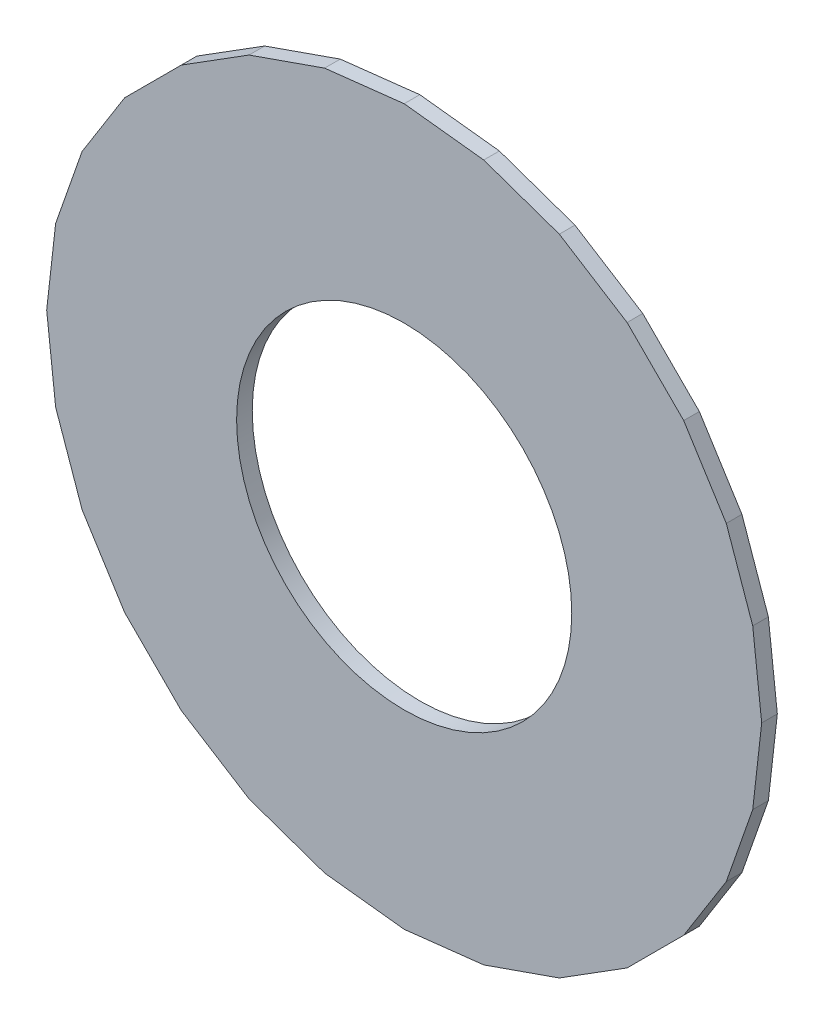
ISO-10303-21;
HEADER;
FILE_DESCRIPTION(('STEP AP214'),'2;1');
FILE_NAME('part.step','',(''),(''),'','','');
FILE_SCHEMA(('AUTOMOTIVE_DESIGN { 1 0 10303 214 1 1 1 1 }'));
ENDSEC;
DATA;
#1=APPLICATION_CONTEXT('core data for automotive mechanical design processes');
#2=APPLICATION_PROTOCOL_DEFINITION('international standard','automotive_design',2000,#1);
#3=PRODUCT_CONTEXT('',#1,'mechanical');
#4=PRODUCT('Part','Part','',(#3));
#5=PRODUCT_RELATED_PRODUCT_CATEGORY('part','',(#4));
#6=PRODUCT_DEFINITION_FORMATION('','',#4);
#7=PRODUCT_DEFINITION_CONTEXT('part definition',#1,'design');
#8=PRODUCT_DEFINITION('design','',#6,#7);
#9=PRODUCT_DEFINITION_SHAPE('','',#8);
#10=(LENGTH_UNIT() NAMED_UNIT(*) SI_UNIT(.MILLI.,.METRE.));
#11=(NAMED_UNIT(*) PLANE_ANGLE_UNIT() SI_UNIT($,.RADIAN.));
#12=(NAMED_UNIT(*) SI_UNIT($,.STERADIAN.) SOLID_ANGLE_UNIT());
#13=UNCERTAINTY_MEASURE_WITH_UNIT(LENGTH_MEASURE(1.E-05),#10,'distance_accuracy_value','');
#14=(GEOMETRIC_REPRESENTATION_CONTEXT(3) GLOBAL_UNCERTAINTY_ASSIGNED_CONTEXT((#13)) GLOBAL_UNIT_ASSIGNED_CONTEXT((#10,
#11,#12)) REPRESENTATION_CONTEXT('',''));
#15=CARTESIAN_POINT('',(0.,0.,0.));
#16=DIRECTION('',(0.,0.,1.));
#17=DIRECTION('',(1.,0.,0.));
#18=AXIS2_PLACEMENT_3D('',#15,#16,#17);
#19=CARTESIAN_POINT('',(165.608,-76.2,-0.045));
#20=DIRECTION('',(0.,0.,-1.));
#21=DIRECTION('',(0.,-1.,0.));
#22=AXIS2_PLACEMENT_3D('',#19,#20,#21);
#23=CYLINDRICAL_SURFACE('',#22,0.375);
#24=CARTESIAN_POINT('',(165.608,-76.2,-0.035));
#25=DIRECTION('',(0.,0.,-1.));
#26=DIRECTION('',(0.,-1.,0.));
#27=AXIS2_PLACEMENT_3D('',#24,#25,#26);
#28=CIRCLE('',#27,0.375);
#29=CARTESIAN_POINT('',(165.608,-76.575,-0.035));
#30=VERTEX_POINT('',#29);
#31=EDGE_CURVE('E325',#30,#30,#28,.T.);
#32=ORIENTED_EDGE('',*,*,#31,.T.);
#33=DIRECTION('',(0.,0.,1.));
#34=VECTOR('',#33,1.);
#35=CARTESIAN_POINT('',(165.608,-76.575,-0.045));
#36=LINE('',#35,#34);
#37=CARTESIAN_POINT('',(165.608,-76.575,0.));
#38=VERTEX_POINT('',#37);
#39=EDGE_CURVE('E11',#30,#38,#36,.T.);
#40=ORIENTED_EDGE('',*,*,#39,.T.);
#41=CARTESIAN_POINT('',(165.608,-76.2,0.));
#42=DIRECTION('',(0.,0.,-1.));
#43=DIRECTION('',(0.,-1.,0.));
#44=AXIS2_PLACEMENT_3D('',#41,#42,#43);
#45=CIRCLE('',#44,0.375);
#46=EDGE_CURVE('E392',#38,#38,#45,.T.);
#47=ORIENTED_EDGE('',*,*,#46,.F.);
#48=ORIENTED_EDGE('',*,*,#39,.F.);
#49=EDGE_LOOP('',(#32,#40,#47,#48));
#50=FACE_BOUND('',#49,.T.);
#51=ADVANCED_FACE('F17',(#50),#23,.F.);
#52=CARTESIAN_POINT('',(165.429983,-76.979942,-0.035));
#53=DIRECTION('',(-0.330278315977027,-0.943883591337077,0.));
#54=DIRECTION('',(-0.943883591337077,0.330278315977027,0.));
#55=AXIS2_PLACEMENT_3D('',#52,#53,#54);
#56=PLANE('',#55);
#57=DIRECTION('',(0.,0.,1.));
#58=VECTOR('',#57,1.);
#59=CARTESIAN_POINT('',(165.429983,-76.979942,-0.035));
#60=LINE('',#59,#58);
#61=CARTESIAN_POINT('',(165.429983,-76.979942,-0.035));
#62=VERTEX_POINT('',#61);
#63=CARTESIAN_POINT('',(165.429983,-76.979942,0.));
#64=VERTEX_POINT('',#63);
#65=EDGE_CURVE('E26',#62,#64,#60,.T.);
#66=ORIENTED_EDGE('',*,*,#65,.T.);
#67=DIRECTION('',(-0.943883591337077,0.330278315977027,0.));
#68=VECTOR('',#67,1.);
#69=CARTESIAN_POINT('',(165.429983,-76.979942,0.));
#70=LINE('',#69,#68);
#71=CARTESIAN_POINT('',(165.260893,-76.920775,0.));
#72=VERTEX_POINT('',#71);
#73=EDGE_CURVE('E320',#64,#72,#70,.T.);
#74=ORIENTED_EDGE('',*,*,#73,.T.);
#75=DIRECTION('',(0.,0.,1.));
#76=VECTOR('',#75,1.);
#77=CARTESIAN_POINT('',(165.260893,-76.920775,-0.035));
#78=LINE('',#77,#76);
#79=CARTESIAN_POINT('',(165.260893,-76.920775,-0.035));
#80=VERTEX_POINT('',#79);
#81=EDGE_CURVE('E441',#80,#72,#78,.T.);
#82=ORIENTED_EDGE('',*,*,#81,.F.);
#83=DIRECTION('',(-0.943883591337077,0.330278315977027,0.));
#84=VECTOR('',#83,1.);
#85=CARTESIAN_POINT('',(165.429983,-76.979942,-0.035));
#86=LINE('',#85,#84);
#87=EDGE_CURVE('E454',#62,#80,#86,.T.);
#88=ORIENTED_EDGE('',*,*,#87,.F.);
#89=EDGE_LOOP('',(#66,#74,#82,#88));
#90=FACE_BOUND('',#89,.T.);
#91=ADVANCED_FACE('F450',(#90),#56,.T.);
#92=CARTESIAN_POINT('',(165.608,-77.,-0.035));
#93=DIRECTION('',(-0.111966136678988,-0.993712022789894,0.));
#94=DIRECTION('',(-0.993712022789894,0.111966136678988,0.));
#95=AXIS2_PLACEMENT_3D('',#92,#93,#94);
#96=PLANE('',#95);
#97=DIRECTION('',(0.,0.,1.));
#98=VECTOR('',#97,1.);
#99=CARTESIAN_POINT('',(165.608,-77.,-0.035));
#100=LINE('',#99,#98);
#101=CARTESIAN_POINT('',(165.608,-77.,-0.035));
#102=VERTEX_POINT('',#101);
#103=CARTESIAN_POINT('',(165.608,-77.,0.));
#104=VERTEX_POINT('',#103);
#105=EDGE_CURVE('E440',#102,#104,#100,.T.);
#106=ORIENTED_EDGE('',*,*,#105,.T.);
#107=DIRECTION('',(-0.993712022789894,0.111966136678988,0.));
#108=VECTOR('',#107,1.);
#109=CARTESIAN_POINT('',(165.608,-77.,0.));
#110=LINE('',#109,#108);
#111=EDGE_CURVE('E372',#104,#64,#110,.T.);
#112=ORIENTED_EDGE('',*,*,#111,.T.);
#113=ORIENTED_EDGE('',*,*,#65,.F.);
#114=DIRECTION('',(-0.993712022789894,0.111966136678988,0.));
#115=VECTOR('',#114,1.);
#116=CARTESIAN_POINT('',(165.608,-77.,-0.035));
#117=LINE('',#116,#115);
#118=EDGE_CURVE('E892',#102,#62,#117,.T.);
#119=ORIENTED_EDGE('',*,*,#118,.F.);
#120=EDGE_LOOP('',(#106,#112,#113,#119));
#121=FACE_BOUND('',#120,.T.);
#122=ADVANCED_FACE('F459',(#121),#96,.T.);
#123=CARTESIAN_POINT('',(165.260893,-76.920775,-0.035));
#124=DIRECTION('',(-0.532032066600227,-0.846724205458361,0.));
#125=DIRECTION('',(-0.846724205458361,0.532032066600227,0.));
#126=AXIS2_PLACEMENT_3D('',#123,#124,#125);
#127=PLANE('',#126);
#128=ORIENTED_EDGE('',*,*,#81,.T.);
#129=DIRECTION('',(-0.846724205458361,0.532032066600227,0.));
#130=VECTOR('',#129,1.);
#131=CARTESIAN_POINT('',(165.260893,-76.920775,0.));
#132=LINE('',#131,#130);
#133=CARTESIAN_POINT('',(165.109208,-76.825465,0.));
#134=VERTEX_POINT('',#133);
#135=EDGE_CURVE('E316',#72,#134,#132,.T.);
#136=ORIENTED_EDGE('',*,*,#135,.T.);
#137=DIRECTION('',(0.,0.,1.));
#138=VECTOR('',#137,1.);
#139=CARTESIAN_POINT('',(165.109208,-76.825465,-0.035));
#140=LINE('',#139,#138);
#141=CARTESIAN_POINT('',(165.109208,-76.825465,-0.035));
#142=VERTEX_POINT('',#141);
#143=EDGE_CURVE('E437',#142,#134,#140,.T.);
#144=ORIENTED_EDGE('',*,*,#143,.F.);
#145=DIRECTION('',(-0.846724205458361,0.532032066600227,0.));
#146=VECTOR('',#145,1.);
#147=CARTESIAN_POINT('',(165.260893,-76.920775,-0.035));
#148=LINE('',#147,#146);
#149=EDGE_CURVE('E473',#80,#142,#148,.T.);
#150=ORIENTED_EDGE('',*,*,#149,.F.);
#151=EDGE_LOOP('',(#128,#136,#144,#150));
#152=FACE_BOUND('',#151,.T.);
#153=ADVANCED_FACE('F748',(#152),#127,.T.);
#154=CARTESIAN_POINT('',(165.786017,-76.979942,-0.035));
#155=DIRECTION('',(0.111966136678988,-0.993712022789894,0.));
#156=DIRECTION('',(0.,0.,-1.));
#157=AXIS2_PLACEMENT_3D('',#154,#155,#156);
#158=PLANE('',#157);
#159=DIRECTION('',(0.,0.,1.));
#160=VECTOR('',#159,1.);
#161=CARTESIAN_POINT('',(165.786017,-76.979942,-0.035));
#162=LINE('',#161,#160);
#163=CARTESIAN_POINT('',(165.786017,-76.979942,-0.035));
#164=VERTEX_POINT('',#163);
#165=CARTESIAN_POINT('',(165.786017,-76.979942,0.));
#166=VERTEX_POINT('',#165);
#167=EDGE_CURVE('E434',#164,#166,#162,.T.);
#168=ORIENTED_EDGE('',*,*,#167,.T.);
#169=DIRECTION('',(-0.993712022789894,-0.111966136678988,0.));
#170=VECTOR('',#169,1.);
#171=CARTESIAN_POINT('',(165.786017,-76.979942,0.));
#172=LINE('',#171,#170);
#173=EDGE_CURVE('E367',#166,#104,#172,.T.);
#174=ORIENTED_EDGE('',*,*,#173,.T.);
#175=ORIENTED_EDGE('',*,*,#105,.F.);
#176=DIRECTION('',(-0.993712022789894,-0.111966136678988,0.));
#177=VECTOR('',#176,1.);
#178=CARTESIAN_POINT('',(165.786017,-76.979942,-0.035));
#179=LINE('',#178,#177);
#180=EDGE_CURVE('E884',#164,#102,#179,.T.);
#181=ORIENTED_EDGE('',*,*,#180,.F.);
#182=EDGE_LOOP('',(#168,#174,#175,#181));
#183=FACE_BOUND('',#182,.T.);
#184=ADVANCED_FACE('F739',(#183),#158,.T.);
#185=CARTESIAN_POINT('',(165.109208,-76.825465,-0.035));
#186=DIRECTION('',(-0.707106781186548,-0.707106781186548,0.));
#187=DIRECTION('',(-0.707106781186548,0.707106781186548,0.));
#188=AXIS2_PLACEMENT_3D('',#185,#186,#187);
#189=PLANE('',#188);
#190=ORIENTED_EDGE('',*,*,#143,.T.);
#191=DIRECTION('',(-0.707106781186548,0.707106781186548,0.));
#192=VECTOR('',#191,1.);
#193=CARTESIAN_POINT('',(165.109208,-76.825465,0.));
#194=LINE('',#193,#192);
#195=CARTESIAN_POINT('',(164.982535,-76.698792,0.));
#196=VERTEX_POINT('',#195);
#197=EDGE_CURVE('E321',#134,#196,#194,.T.);
#198=ORIENTED_EDGE('',*,*,#197,.T.);
#199=DIRECTION('',(0.,0.,1.));
#200=VECTOR('',#199,1.);
#201=CARTESIAN_POINT('',(164.982535,-76.698792,-0.035));
#202=LINE('',#201,#200);
#203=CARTESIAN_POINT('',(164.982535,-76.698792,-0.035));
#204=VERTEX_POINT('',#203);
#205=EDGE_CURVE('E431',#204,#196,#202,.T.);
#206=ORIENTED_EDGE('',*,*,#205,.F.);
#207=DIRECTION('',(-0.707106781186548,0.707106781186548,0.));
#208=VECTOR('',#207,1.);
#209=CARTESIAN_POINT('',(165.109208,-76.825465,-0.035));
#210=LINE('',#209,#208);
#211=EDGE_CURVE('E475',#142,#204,#210,.T.);
#212=ORIENTED_EDGE('',*,*,#211,.F.);
#213=EDGE_LOOP('',(#190,#198,#206,#212));
#214=FACE_BOUND('',#213,.T.);
#215=ADVANCED_FACE('F730',(#214),#189,.T.);
#216=CARTESIAN_POINT('',(165.955107,-76.920775,-0.035));
#217=DIRECTION('',(0.330278315977027,-0.943883591337077,0.));
#218=DIRECTION('',(0.,0.,-1.));
#219=AXIS2_PLACEMENT_3D('',#216,#217,#218);
#220=PLANE('',#219);
#221=DIRECTION('',(0.,0.,1.));
#222=VECTOR('',#221,1.);
#223=CARTESIAN_POINT('',(165.955107,-76.920775,-0.035));
#224=LINE('',#223,#222);
#225=CARTESIAN_POINT('',(165.955107,-76.920775,-0.035));
#226=VERTEX_POINT('',#225);
#227=CARTESIAN_POINT('',(165.955107,-76.920775,0.));
#228=VERTEX_POINT('',#227);
#229=EDGE_CURVE('E428',#226,#228,#224,.T.);
#230=ORIENTED_EDGE('',*,*,#229,.T.);
#231=DIRECTION('',(-0.943883591337077,-0.330278315977027,0.));
#232=VECTOR('',#231,1.);
#233=CARTESIAN_POINT('',(165.955107,-76.920775,0.));
#234=LINE('',#233,#232);
#235=EDGE_CURVE('E371',#228,#166,#234,.T.);
#236=ORIENTED_EDGE('',*,*,#235,.T.);
#237=ORIENTED_EDGE('',*,*,#167,.F.);
#238=DIRECTION('',(-0.943883591337077,-0.330278315977027,0.));
#239=VECTOR('',#238,1.);
#240=CARTESIAN_POINT('',(165.955107,-76.920775,-0.035));
#241=LINE('',#240,#239);
#242=EDGE_CURVE('E880',#226,#164,#241,.T.);
#243=ORIENTED_EDGE('',*,*,#242,.F.);
#244=EDGE_LOOP('',(#230,#236,#237,#243));
#245=FACE_BOUND('',#244,.T.);
#246=ADVANCED_FACE('F722',(#245),#220,.T.);
#247=CARTESIAN_POINT('',(164.982535,-76.698792,-0.035));
#248=DIRECTION('',(-0.846724205458361,-0.532032066600227,0.));
#249=DIRECTION('',(-0.532032066600227,0.846724205458361,0.));
#250=AXIS2_PLACEMENT_3D('',#247,#248,#249);
#251=PLANE('',#250);
#252=ORIENTED_EDGE('',*,*,#205,.T.);
#253=DIRECTION('',(-0.532032066600227,0.846724205458361,0.));
#254=VECTOR('',#253,1.);
#255=CARTESIAN_POINT('',(164.982535,-76.698792,0.));
#256=LINE('',#255,#254);
#257=CARTESIAN_POINT('',(164.887225,-76.547107,0.));
#258=VERTEX_POINT('',#257);
#259=EDGE_CURVE('E366',#196,#258,#256,.T.);
#260=ORIENTED_EDGE('',*,*,#259,.T.);
#261=DIRECTION('',(0.,0.,1.));
#262=VECTOR('',#261,1.);
#263=CARTESIAN_POINT('',(164.887225,-76.547107,-0.035));
#264=LINE('',#263,#262);
#265=CARTESIAN_POINT('',(164.887225,-76.547107,-0.035));
#266=VERTEX_POINT('',#265);
#267=EDGE_CURVE('E425',#266,#258,#264,.T.);
#268=ORIENTED_EDGE('',*,*,#267,.F.);
#269=DIRECTION('',(-0.532032066600227,0.846724205458361,0.));
#270=VECTOR('',#269,1.);
#271=CARTESIAN_POINT('',(164.982535,-76.698792,-0.035));
#272=LINE('',#271,#270);
#273=EDGE_CURVE('E279',#204,#266,#272,.T.);
#274=ORIENTED_EDGE('',*,*,#273,.F.);
#275=EDGE_LOOP('',(#252,#260,#268,#274));
#276=FACE_BOUND('',#275,.T.);
#277=ADVANCED_FACE('F485',(#276),#251,.T.);
#278=CARTESIAN_POINT('',(166.106792,-76.825465,-0.035));
#279=DIRECTION('',(0.532032066600227,-0.846724205458361,0.));
#280=DIRECTION('',(0.,0.,-1.));
#281=AXIS2_PLACEMENT_3D('',#278,#279,#280);
#282=PLANE('',#281);
#283=DIRECTION('',(0.,0.,1.));
#284=VECTOR('',#283,1.);
#285=CARTESIAN_POINT('',(166.106792,-76.825465,-0.035));
#286=LINE('',#285,#284);
#287=CARTESIAN_POINT('',(166.106792,-76.825465,-0.035));
#288=VERTEX_POINT('',#287);
#289=CARTESIAN_POINT('',(166.106792,-76.825465,0.));
#290=VERTEX_POINT('',#289);
#291=EDGE_CURVE('E422',#288,#290,#286,.T.);
#292=ORIENTED_EDGE('',*,*,#291,.T.);
#293=DIRECTION('',(-0.846724205458361,-0.532032066600227,0.));
#294=VECTOR('',#293,1.);
#295=CARTESIAN_POINT('',(166.106792,-76.825465,0.));
#296=LINE('',#295,#294);
#297=EDGE_CURVE('E348',#290,#228,#296,.T.);
#298=ORIENTED_EDGE('',*,*,#297,.T.);
#299=ORIENTED_EDGE('',*,*,#229,.F.);
#300=DIRECTION('',(-0.846724205458361,-0.532032066600227,0.));
#301=VECTOR('',#300,1.);
#302=CARTESIAN_POINT('',(166.106792,-76.825465,-0.035));
#303=LINE('',#302,#301);
#304=EDGE_CURVE('E876',#288,#226,#303,.T.);
#305=ORIENTED_EDGE('',*,*,#304,.F.);
#306=EDGE_LOOP('',(#292,#298,#299,#305));
#307=FACE_BOUND('',#306,.T.);
#308=ADVANCED_FACE('F492',(#307),#282,.T.);
#309=CARTESIAN_POINT('',(164.887225,-76.547107,-0.035));
#310=DIRECTION('',(-0.943883591337077,-0.330278315977027,0.));
#311=DIRECTION('',(-0.330278315977027,0.943883591337077,0.));
#312=AXIS2_PLACEMENT_3D('',#309,#310,#311);
#313=PLANE('',#312);
#314=ORIENTED_EDGE('',*,*,#267,.T.);
#315=DIRECTION('',(-0.330278315977027,0.943883591337077,0.));
#316=VECTOR('',#315,1.);
#317=CARTESIAN_POINT('',(164.887225,-76.547107,0.));
#318=LINE('',#317,#316);
#319=CARTESIAN_POINT('',(164.828058,-76.378017,0.));
#320=VERTEX_POINT('',#319);
#321=EDGE_CURVE('E362',#258,#320,#318,.T.);
#322=ORIENTED_EDGE('',*,*,#321,.T.);
#323=DIRECTION('',(0.,0.,1.));
#324=VECTOR('',#323,1.);
#325=CARTESIAN_POINT('',(164.828058,-76.378017,-0.035));
#326=LINE('',#325,#324);
#327=CARTESIAN_POINT('',(164.828058,-76.378017,-0.035));
#328=VERTEX_POINT('',#327);
#329=EDGE_CURVE('E237',#328,#320,#326,.T.);
#330=ORIENTED_EDGE('',*,*,#329,.F.);
#331=DIRECTION('',(-0.330278315977027,0.943883591337077,0.));
#332=VECTOR('',#331,1.);
#333=CARTESIAN_POINT('',(164.887225,-76.547107,-0.035));
#334=LINE('',#333,#332);
#335=EDGE_CURVE('E272',#266,#328,#334,.T.);
#336=ORIENTED_EDGE('',*,*,#335,.F.);
#337=EDGE_LOOP('',(#314,#322,#330,#336));
#338=FACE_BOUND('',#337,.T.);
#339=ADVANCED_FACE('F489',(#338),#313,.T.);
#340=CARTESIAN_POINT('',(166.233465,-76.698792,-0.035));
#341=DIRECTION('',(0.707106781186548,-0.707106781186548,0.));
#342=DIRECTION('',(0.,0.,-1.));
#343=AXIS2_PLACEMENT_3D('',#340,#341,#342);
#344=PLANE('',#343);
#345=DIRECTION('',(0.,0.,1.));
#346=VECTOR('',#345,1.);
#347=CARTESIAN_POINT('',(166.233465,-76.698792,-0.035));
#348=LINE('',#347,#346);
#349=CARTESIAN_POINT('',(166.233465,-76.698792,-0.035));
#350=VERTEX_POINT('',#349);
#351=CARTESIAN_POINT('',(166.233465,-76.698792,0.));
#352=VERTEX_POINT('',#351);
#353=EDGE_CURVE('E256',#350,#352,#348,.T.);
#354=ORIENTED_EDGE('',*,*,#353,.T.);
#355=DIRECTION('',(-0.707106781186548,-0.707106781186548,0.));
#356=VECTOR('',#355,1.);
#357=CARTESIAN_POINT('',(166.233465,-76.698792,0.));
#358=LINE('',#357,#356);
#359=EDGE_CURVE('E343',#352,#290,#358,.T.);
#360=ORIENTED_EDGE('',*,*,#359,.T.);
#361=ORIENTED_EDGE('',*,*,#291,.F.);
#362=DIRECTION('',(-0.707106781186548,-0.707106781186548,0.));
#363=VECTOR('',#362,1.);
#364=CARTESIAN_POINT('',(166.233465,-76.698792,-0.035));
#365=LINE('',#364,#363);
#366=EDGE_CURVE('E872',#350,#288,#365,.T.);
#367=ORIENTED_EDGE('',*,*,#366,.F.);
#368=EDGE_LOOP('',(#354,#360,#361,#367));
#369=FACE_BOUND('',#368,.T.);
#370=ADVANCED_FACE('F491',(#369),#344,.T.);
#371=CARTESIAN_POINT('',(164.828058,-76.378017,-0.035));
#372=DIRECTION('',(-0.993712022789894,-0.111966136678988,0.));
#373=DIRECTION('',(-0.111966136678988,0.993712022789894,0.));
#374=AXIS2_PLACEMENT_3D('',#371,#372,#373);
#375=PLANE('',#374);
#376=ORIENTED_EDGE('',*,*,#329,.T.);
#377=DIRECTION('',(-0.111966136678988,0.993712022789894,0.));
#378=VECTOR('',#377,1.);
#379=CARTESIAN_POINT('',(164.828058,-76.378017,0.));
#380=LINE('',#379,#378);
#381=CARTESIAN_POINT('',(164.808,-76.2,0.));
#382=VERTEX_POINT('',#381);
#383=EDGE_CURVE('E251',#320,#382,#380,.T.);
#384=ORIENTED_EDGE('',*,*,#383,.T.);
#385=DIRECTION('',(0.,0.,1.));
#386=VECTOR('',#385,1.);
#387=CARTESIAN_POINT('',(164.808,-76.2,-0.035));
#388=LINE('',#387,#386);
#389=CARTESIAN_POINT('',(164.808,-76.2,-0.035));
#390=VERTEX_POINT('',#389);
#391=EDGE_CURVE('E244',#390,#382,#388,.T.);
#392=ORIENTED_EDGE('',*,*,#391,.F.);
#393=DIRECTION('',(-0.111966136678988,0.993712022789894,0.));
#394=VECTOR('',#393,1.);
#395=CARTESIAN_POINT('',(164.828058,-76.378017,-0.035));
#396=LINE('',#395,#394);
#397=EDGE_CURVE('E248',#328,#390,#396,.T.);
#398=ORIENTED_EDGE('',*,*,#397,.F.);
#399=EDGE_LOOP('',(#376,#384,#392,#398));
#400=FACE_BOUND('',#399,.T.);
#401=ADVANCED_FACE('F246',(#400),#375,.T.);
#402=CARTESIAN_POINT('',(166.328775,-76.547107,-0.035));
#403=DIRECTION('',(0.846724205458361,-0.532032066600227,0.));
#404=DIRECTION('',(0.,0.,-1.));
#405=AXIS2_PLACEMENT_3D('',#402,#403,#404);
#406=PLANE('',#405);
#407=DIRECTION('',(0.,0.,1.));
#408=VECTOR('',#407,1.);
#409=CARTESIAN_POINT('',(166.328775,-76.547107,-0.035));
#410=LINE('',#409,#408);
#411=CARTESIAN_POINT('',(166.328775,-76.547107,-0.035));
#412=VERTEX_POINT('',#411);
#413=CARTESIAN_POINT('',(166.328775,-76.547107,0.));
#414=VERTEX_POINT('',#413);
#415=EDGE_CURVE('E257',#412,#414,#410,.T.);
#416=ORIENTED_EDGE('',*,*,#415,.T.);
#417=DIRECTION('',(-0.532032066600227,-0.846724205458361,0.));
#418=VECTOR('',#417,1.);
#419=CARTESIAN_POINT('',(166.328775,-76.547107,0.));
#420=LINE('',#419,#418);
#421=EDGE_CURVE('E347',#414,#352,#420,.T.);
#422=ORIENTED_EDGE('',*,*,#421,.T.);
#423=ORIENTED_EDGE('',*,*,#353,.F.);
#424=DIRECTION('',(-0.532032066600227,-0.846724205458361,0.));
#425=VECTOR('',#424,1.);
#426=CARTESIAN_POINT('',(166.328775,-76.547107,-0.035));
#427=LINE('',#426,#425);
#428=EDGE_CURVE('E868',#412,#350,#427,.T.);
#429=ORIENTED_EDGE('',*,*,#428,.F.);
#430=EDGE_LOOP('',(#416,#422,#423,#429));
#431=FACE_BOUND('',#430,.T.);
#432=ADVANCED_FACE('F566',(#431),#406,.T.);
#433=CARTESIAN_POINT('',(164.808,-76.2,-0.035));
#434=DIRECTION('',(-0.993712022789894,0.111966136678988,0.));
#435=DIRECTION('',(0.,0.,1.));
#436=AXIS2_PLACEMENT_3D('',#433,#434,#435);
#437=PLANE('',#436);
#438=ORIENTED_EDGE('',*,*,#391,.T.);
#439=DIRECTION('',(0.111966136678988,0.993712022789894,0.));
#440=VECTOR('',#439,1.);
#441=CARTESIAN_POINT('',(164.808,-76.2,0.));
#442=LINE('',#441,#440);
#443=CARTESIAN_POINT('',(164.828058,-76.021983,0.));
#444=VERTEX_POINT('',#443);
#445=EDGE_CURVE('E352',#382,#444,#442,.T.);
#446=ORIENTED_EDGE('',*,*,#445,.T.);
#447=DIRECTION('',(0.,0.,1.));
#448=VECTOR('',#447,1.);
#449=CARTESIAN_POINT('',(164.828058,-76.021983,-0.035));
#450=LINE('',#449,#448);
#451=CARTESIAN_POINT('',(164.828058,-76.021983,-0.035));
#452=VERTEX_POINT('',#451);
#453=EDGE_CURVE('E262',#452,#444,#450,.T.);
#454=ORIENTED_EDGE('',*,*,#453,.F.);
#455=DIRECTION('',(0.111966136678988,0.993712022789894,0.));
#456=VECTOR('',#455,1.);
#457=CARTESIAN_POINT('',(164.808,-76.2,-0.035));
#458=LINE('',#457,#456);
#459=EDGE_CURVE('E260',#390,#452,#458,.T.);
#460=ORIENTED_EDGE('',*,*,#459,.F.);
#461=EDGE_LOOP('',(#438,#446,#454,#460));
#462=FACE_BOUND('',#461,.T.);
#463=ADVANCED_FACE('F261',(#462),#437,.T.);
#464=CARTESIAN_POINT('',(166.387942,-76.378017,-0.035));
#465=DIRECTION('',(0.943883591337077,-0.330278315977027,0.));
#466=DIRECTION('',(0.,0.,-1.));
#467=AXIS2_PLACEMENT_3D('',#464,#465,#466);
#468=PLANE('',#467);
#469=DIRECTION('',(0.,0.,1.));
#470=VECTOR('',#469,1.);
#471=CARTESIAN_POINT('',(166.387942,-76.378017,-0.035));
#472=LINE('',#471,#470);
#473=CARTESIAN_POINT('',(166.387942,-76.378017,-0.035));
#474=VERTEX_POINT('',#473);
#475=CARTESIAN_POINT('',(166.387942,-76.378017,0.));
#476=VERTEX_POINT('',#475);
#477=EDGE_CURVE('E415',#474,#476,#472,.T.);
#478=ORIENTED_EDGE('',*,*,#477,.T.);
#479=DIRECTION('',(-0.330278315977027,-0.943883591337077,0.));
#480=VECTOR('',#479,1.);
#481=CARTESIAN_POINT('',(166.387942,-76.378017,0.));
#482=LINE('',#481,#480);
#483=EDGE_CURVE('E382',#476,#414,#482,.T.);
#484=ORIENTED_EDGE('',*,*,#483,.T.);
#485=ORIENTED_EDGE('',*,*,#415,.F.);
#486=DIRECTION('',(-0.330278315977027,-0.943883591337077,0.));
#487=VECTOR('',#486,1.);
#488=CARTESIAN_POINT('',(166.387942,-76.378017,-0.035));
#489=LINE('',#488,#487);
#490=EDGE_CURVE('E847',#474,#412,#489,.T.);
#491=ORIENTED_EDGE('',*,*,#490,.F.);
#492=EDGE_LOOP('',(#478,#484,#485,#491));
#493=FACE_BOUND('',#492,.T.);
#494=ADVANCED_FACE('F553',(#493),#468,.T.);
#495=CARTESIAN_POINT('',(164.828058,-76.021983,-0.035));
#496=DIRECTION('',(-0.943883591337077,0.330278315977027,0.));
#497=DIRECTION('',(0.,0.,1.));
#498=AXIS2_PLACEMENT_3D('',#495,#496,#497);
#499=PLANE('',#498);
#500=ORIENTED_EDGE('',*,*,#453,.T.);
#501=DIRECTION('',(0.330278315977027,0.943883591337077,0.));
#502=VECTOR('',#501,1.);
#503=CARTESIAN_POINT('',(164.828058,-76.021983,0.));
#504=LINE('',#503,#502);
#505=CARTESIAN_POINT('',(164.887225,-75.852893,0.));
#506=VERTEX_POINT('',#505);
#507=EDGE_CURVE('E292',#444,#506,#504,.T.);
#508=ORIENTED_EDGE('',*,*,#507,.T.);
#509=DIRECTION('',(0.,0.,1.));
#510=VECTOR('',#509,1.);
#511=CARTESIAN_POINT('',(164.887225,-75.852893,-0.035));
#512=LINE('',#511,#510);
#513=CARTESIAN_POINT('',(164.887225,-75.852893,-0.035));
#514=VERTEX_POINT('',#513);
#515=EDGE_CURVE('E412',#514,#506,#512,.T.);
#516=ORIENTED_EDGE('',*,*,#515,.F.);
#517=DIRECTION('',(0.330278315977027,0.943883591337077,0.));
#518=VECTOR('',#517,1.);
#519=CARTESIAN_POINT('',(164.828058,-76.021983,-0.035));
#520=LINE('',#519,#518);
#521=EDGE_CURVE('E267',#452,#514,#520,.T.);
#522=ORIENTED_EDGE('',*,*,#521,.F.);
#523=EDGE_LOOP('',(#500,#508,#516,#522));
#524=FACE_BOUND('',#523,.T.);
#525=ADVANCED_FACE('F549',(#524),#499,.T.);
#526=CARTESIAN_POINT('',(166.408,-76.2,-0.035));
#527=DIRECTION('',(0.993712022789894,-0.111966136678988,0.));
#528=DIRECTION('',(0.,0.,-1.));
#529=AXIS2_PLACEMENT_3D('',#526,#527,#528);
#530=PLANE('',#529);
#531=DIRECTION('',(0.,0.,1.));
#532=VECTOR('',#531,1.);
#533=CARTESIAN_POINT('',(166.408,-76.2,-0.035));
#534=LINE('',#533,#532);
#535=CARTESIAN_POINT('',(166.408,-76.2,-0.035));
#536=VERTEX_POINT('',#535);
#537=CARTESIAN_POINT('',(166.408,-76.2,0.));
#538=VERTEX_POINT('',#537);
#539=EDGE_CURVE('E359',#536,#538,#534,.T.);
#540=ORIENTED_EDGE('',*,*,#539,.T.);
#541=DIRECTION('',(-0.111966136678988,-0.993712022789894,0.));
#542=VECTOR('',#541,1.);
#543=CARTESIAN_POINT('',(166.408,-76.2,0.));
#544=LINE('',#543,#542);
#545=EDGE_CURVE('E385',#538,#476,#544,.T.);
#546=ORIENTED_EDGE('',*,*,#545,.T.);
#547=ORIENTED_EDGE('',*,*,#477,.F.);
#548=DIRECTION('',(-0.111966136678988,-0.993712022789894,0.));
#549=VECTOR('',#548,1.);
#550=CARTESIAN_POINT('',(166.408,-76.2,-0.035));
#551=LINE('',#550,#549);
#552=EDGE_CURVE('E843',#536,#474,#551,.T.);
#553=ORIENTED_EDGE('',*,*,#552,.F.);
#554=EDGE_LOOP('',(#540,#546,#547,#553));
#555=FACE_BOUND('',#554,.T.);
#556=ADVANCED_FACE('F552',(#555),#530,.T.);
#557=CARTESIAN_POINT('',(164.887225,-75.852893,-0.035));
#558=DIRECTION('',(-0.846724205458361,0.532032066600227,0.));
#559=DIRECTION('',(0.,0.,1.));
#560=AXIS2_PLACEMENT_3D('',#557,#558,#559);
#561=PLANE('',#560);
#562=ORIENTED_EDGE('',*,*,#515,.T.);
#563=DIRECTION('',(0.532032066600227,0.846724205458361,0.));
#564=VECTOR('',#563,1.);
#565=CARTESIAN_POINT('',(164.887225,-75.852893,0.));
#566=LINE('',#565,#564);
#567=CARTESIAN_POINT('',(164.982535,-75.701208,0.));
#568=VERTEX_POINT('',#567);
#569=EDGE_CURVE('E288',#506,#568,#566,.T.);
#570=ORIENTED_EDGE('',*,*,#569,.T.);
#571=DIRECTION('',(0.,0.,1.));
#572=VECTOR('',#571,1.);
#573=CARTESIAN_POINT('',(164.982535,-75.701208,-0.035));
#574=LINE('',#573,#572);
#575=CARTESIAN_POINT('',(164.982535,-75.701208,-0.035));
#576=VERTEX_POINT('',#575);
#577=EDGE_CURVE('E355',#576,#568,#574,.T.);
#578=ORIENTED_EDGE('',*,*,#577,.F.);
#579=DIRECTION('',(0.532032066600227,0.846724205458361,0.));
#580=VECTOR('',#579,1.);
#581=CARTESIAN_POINT('',(164.887225,-75.852893,-0.035));
#582=LINE('',#581,#580);
#583=EDGE_CURVE('E296',#514,#576,#582,.T.);
#584=ORIENTED_EDGE('',*,*,#583,.F.);
#585=EDGE_LOOP('',(#562,#570,#578,#584));
#586=FACE_BOUND('',#585,.T.);
#587=ADVANCED_FACE('F548',(#586),#561,.T.);
#588=CARTESIAN_POINT('',(166.387942,-76.021983,-0.035));
#589=DIRECTION('',(0.993712022789894,0.111966136678988,0.));
#590=DIRECTION('',(0.,0.,-1.));
#591=AXIS2_PLACEMENT_3D('',#588,#589,#590);
#592=PLANE('',#591);
#593=DIRECTION('',(0.,0.,1.));
#594=VECTOR('',#593,1.);
#595=CARTESIAN_POINT('',(166.387942,-76.021983,-0.035));
#596=LINE('',#595,#594);
#597=CARTESIAN_POINT('',(166.387942,-76.021983,-0.035));
#598=VERTEX_POINT('',#597);
#599=CARTESIAN_POINT('',(166.387942,-76.021983,0.));
#600=VERTEX_POINT('',#599);
#601=EDGE_CURVE('E156',#598,#600,#596,.T.);
#602=ORIENTED_EDGE('',*,*,#601,.T.);
#603=DIRECTION('',(0.111966136678988,-0.993712022789894,0.));
#604=VECTOR('',#603,1.);
#605=CARTESIAN_POINT('',(166.387942,-76.021983,0.));
#606=LINE('',#605,#604);
#607=EDGE_CURVE('E299',#600,#538,#606,.T.);
#608=ORIENTED_EDGE('',*,*,#607,.T.);
#609=ORIENTED_EDGE('',*,*,#539,.F.);
#610=DIRECTION('',(0.111966136678988,-0.993712022789894,0.));
#611=VECTOR('',#610,1.);
#612=CARTESIAN_POINT('',(166.387942,-76.021983,-0.035));
#613=LINE('',#612,#611);
#614=EDGE_CURVE('E848',#598,#536,#613,.T.);
#615=ORIENTED_EDGE('',*,*,#614,.F.);
#616=EDGE_LOOP('',(#602,#608,#609,#615));
#617=FACE_BOUND('',#616,.T.);
#618=ADVANCED_FACE('F541',(#617),#592,.T.);
#619=CARTESIAN_POINT('',(164.982535,-75.701208,-0.035));
#620=DIRECTION('',(-0.707106781186548,0.707106781186548,0.));
#621=DIRECTION('',(0.,0.,1.));
#622=AXIS2_PLACEMENT_3D('',#619,#620,#621);
#623=PLANE('',#622);
#624=ORIENTED_EDGE('',*,*,#577,.T.);
#625=DIRECTION('',(0.707106781186548,0.707106781186548,0.));
#626=VECTOR('',#625,1.);
#627=CARTESIAN_POINT('',(164.982535,-75.701208,0.));
#628=LINE('',#627,#626);
#629=CARTESIAN_POINT('',(165.109208,-75.574535,0.));
#630=VERTEX_POINT('',#629);
#631=EDGE_CURVE('E293',#568,#630,#628,.T.);
#632=ORIENTED_EDGE('',*,*,#631,.T.);
#633=DIRECTION('',(0.,0.,1.));
#634=VECTOR('',#633,1.);
#635=CARTESIAN_POINT('',(165.109208,-75.574535,-0.035));
#636=LINE('',#635,#634);
#637=CARTESIAN_POINT('',(165.109208,-75.574535,-0.035));
#638=VERTEX_POINT('',#637);
#639=EDGE_CURVE('E304',#638,#630,#636,.T.);
#640=ORIENTED_EDGE('',*,*,#639,.F.);
#641=DIRECTION('',(0.707106781186548,0.707106781186548,0.));
#642=VECTOR('',#641,1.);
#643=CARTESIAN_POINT('',(164.982535,-75.701208,-0.035));
#644=LINE('',#643,#642);
#645=EDGE_CURVE('E303',#576,#638,#644,.T.);
#646=ORIENTED_EDGE('',*,*,#645,.F.);
#647=EDGE_LOOP('',(#624,#632,#640,#646));
#648=FACE_BOUND('',#647,.T.);
#649=ADVANCED_FACE('F538',(#648),#623,.T.);
#650=CARTESIAN_POINT('',(166.328775,-75.852893,-0.035));
#651=DIRECTION('',(0.943883591337077,0.330278315977027,0.));
#652=DIRECTION('',(0.,0.,-1.));
#653=AXIS2_PLACEMENT_3D('',#650,#651,#652);
#654=PLANE('',#653);
#655=DIRECTION('',(0.,0.,1.));
#656=VECTOR('',#655,1.);
#657=CARTESIAN_POINT('',(166.328775,-75.852893,-0.035));
#658=LINE('',#657,#656);
#659=CARTESIAN_POINT('',(166.328775,-75.852893,-0.035));
#660=VERTEX_POINT('',#659);
#661=CARTESIAN_POINT('',(166.328775,-75.852893,0.));
#662=VERTEX_POINT('',#661);
#663=EDGE_CURVE('E167',#660,#662,#658,.T.);
#664=ORIENTED_EDGE('',*,*,#663,.T.);
#665=DIRECTION('',(0.330278315977027,-0.943883591337077,0.));
#666=VECTOR('',#665,1.);
#667=CARTESIAN_POINT('',(166.328775,-75.852893,0.));
#668=LINE('',#667,#666);
#669=EDGE_CURVE('E286',#662,#600,#668,.T.);
#670=ORIENTED_EDGE('',*,*,#669,.T.);
#671=ORIENTED_EDGE('',*,*,#601,.F.);
#672=DIRECTION('',(0.330278315977027,-0.943883591337077,0.));
#673=VECTOR('',#672,1.);
#674=CARTESIAN_POINT('',(166.328775,-75.852893,-0.035));
#675=LINE('',#674,#673);
#676=EDGE_CURVE('E861',#660,#598,#675,.T.);
#677=ORIENTED_EDGE('',*,*,#676,.F.);
#678=EDGE_LOOP('',(#664,#670,#671,#677));
#679=FACE_BOUND('',#678,.T.);
#680=ADVANCED_FACE('F526',(#679),#654,.T.);
#681=CARTESIAN_POINT('',(165.109208,-75.574535,-0.035));
#682=DIRECTION('',(-0.532032066600227,0.846724205458361,0.));
#683=DIRECTION('',(0.,0.,1.));
#684=AXIS2_PLACEMENT_3D('',#681,#682,#683);
#685=PLANE('',#684);
#686=ORIENTED_EDGE('',*,*,#639,.T.);
#687=DIRECTION('',(0.846724205458361,0.532032066600227,0.));
#688=VECTOR('',#687,1.);
#689=CARTESIAN_POINT('',(165.109208,-75.574535,0.));
#690=LINE('',#689,#688);
#691=CARTESIAN_POINT('',(165.260893,-75.479225,0.));
#692=VERTEX_POINT('',#691);
#693=EDGE_CURVE('E336',#630,#692,#690,.T.);
#694=ORIENTED_EDGE('',*,*,#693,.T.);
#695=DIRECTION('',(0.,0.,1.));
#696=VECTOR('',#695,1.);
#697=CARTESIAN_POINT('',(165.260893,-75.479225,-0.035));
#698=LINE('',#697,#696);
#699=CARTESIAN_POINT('',(165.260893,-75.479225,-0.035));
#700=VERTEX_POINT('',#699);
#701=EDGE_CURVE('E398',#700,#692,#698,.T.);
#702=ORIENTED_EDGE('',*,*,#701,.F.);
#703=DIRECTION('',(0.846724205458361,0.532032066600227,0.));
#704=VECTOR('',#703,1.);
#705=CARTESIAN_POINT('',(165.109208,-75.574535,-0.035));
#706=LINE('',#705,#704);
#707=EDGE_CURVE('E307',#638,#700,#706,.T.);
#708=ORIENTED_EDGE('',*,*,#707,.F.);
#709=EDGE_LOOP('',(#686,#694,#702,#708));
#710=FACE_BOUND('',#709,.T.);
#711=ADVANCED_FACE('F536',(#710),#685,.T.);
#712=CARTESIAN_POINT('',(166.233465,-75.701208,-0.035));
#713=DIRECTION('',(0.846724205458361,0.532032066600227,0.));
#714=DIRECTION('',(0.,0.,-1.));
#715=AXIS2_PLACEMENT_3D('',#712,#713,#714);
#716=PLANE('',#715);
#717=DIRECTION('',(0.,0.,1.));
#718=VECTOR('',#717,1.);
#719=CARTESIAN_POINT('',(166.233465,-75.701208,-0.035));
#720=LINE('',#719,#718);
#721=CARTESIAN_POINT('',(166.233465,-75.701208,-0.035));
#722=VERTEX_POINT('',#721);
#723=CARTESIAN_POINT('',(166.233465,-75.701208,0.));
#724=VERTEX_POINT('',#723);
#725=EDGE_CURVE('E401',#722,#724,#720,.T.);
#726=ORIENTED_EDGE('',*,*,#725,.T.);
#727=DIRECTION('',(0.532032066600227,-0.846724205458361,0.));
#728=VECTOR('',#727,1.);
#729=CARTESIAN_POINT('',(166.233465,-75.701208,0.));
#730=LINE('',#729,#728);
#731=EDGE_CURVE('E283',#724,#662,#730,.T.);
#732=ORIENTED_EDGE('',*,*,#731,.T.);
#733=ORIENTED_EDGE('',*,*,#663,.F.);
#734=DIRECTION('',(0.532032066600227,-0.846724205458361,0.));
#735=VECTOR('',#734,1.);
#736=CARTESIAN_POINT('',(166.233465,-75.701208,-0.035));
#737=LINE('',#736,#735);
#738=EDGE_CURVE('E853',#722,#660,#737,.T.);
#739=ORIENTED_EDGE('',*,*,#738,.F.);
#740=EDGE_LOOP('',(#726,#732,#733,#739));
#741=FACE_BOUND('',#740,.T.);
#742=ADVANCED_FACE('F532',(#741),#716,.T.);
#743=CARTESIAN_POINT('',(165.260893,-75.479225,-0.035));
#744=DIRECTION('',(-0.330278315977918,0.943883591336766,0.));
#745=DIRECTION('',(0.,0.,1.));
#746=AXIS2_PLACEMENT_3D('',#743,#744,#745);
#747=PLANE('',#746);
#748=ORIENTED_EDGE('',*,*,#701,.T.);
#749=DIRECTION('',(0.943883591336766,0.330278315977918,0.));
#750=VECTOR('',#749,1.);
#751=CARTESIAN_POINT('',(165.260893,-75.479225,0.));
#752=LINE('',#751,#750);
#753=CARTESIAN_POINT('',(165.429983,-75.420058,0.));
#754=VERTEX_POINT('',#753);
#755=EDGE_CURVE('E332',#692,#754,#752,.T.);
#756=ORIENTED_EDGE('',*,*,#755,.T.);
#757=DIRECTION('',(0.,0.,1.));
#758=VECTOR('',#757,1.);
#759=CARTESIAN_POINT('',(165.429983,-75.420058,-0.035));
#760=LINE('',#759,#758);
#761=CARTESIAN_POINT('',(165.429983,-75.420058,-0.035));
#762=VERTEX_POINT('',#761);
#763=EDGE_CURVE('E395',#762,#754,#760,.T.);
#764=ORIENTED_EDGE('',*,*,#763,.F.);
#765=DIRECTION('',(0.943883591336766,0.330278315977918,0.));
#766=VECTOR('',#765,1.);
#767=CARTESIAN_POINT('',(165.260893,-75.479225,-0.035));
#768=LINE('',#767,#766);
#769=EDGE_CURVE('E311',#700,#762,#768,.T.);
#770=ORIENTED_EDGE('',*,*,#769,.F.);
#771=EDGE_LOOP('',(#748,#756,#764,#770));
#772=FACE_BOUND('',#771,.T.);
#773=ADVANCED_FACE('F528',(#772),#747,.T.);
#774=CARTESIAN_POINT('',(166.106792,-75.574535,-0.035));
#775=DIRECTION('',(0.707106781186548,0.707106781186548,0.));
#776=DIRECTION('',(0.,0.,-1.));
#777=AXIS2_PLACEMENT_3D('',#774,#775,#776);
#778=PLANE('',#777);
#779=DIRECTION('',(0.,0.,1.));
#780=VECTOR('',#779,1.);
#781=CARTESIAN_POINT('',(166.106792,-75.574535,-0.035));
#782=LINE('',#781,#780);
#783=CARTESIAN_POINT('',(166.106792,-75.574535,-0.035));
#784=VERTEX_POINT('',#783);
#785=CARTESIAN_POINT('',(166.106792,-75.574535,0.));
#786=VERTEX_POINT('',#785);
#787=EDGE_CURVE('E819',#784,#786,#782,.T.);
#788=ORIENTED_EDGE('',*,*,#787,.T.);
#789=DIRECTION('',(0.707106781186548,-0.707106781186548,0.));
#790=VECTOR('',#789,1.);
#791=CARTESIAN_POINT('',(166.106792,-75.574535,0.));
#792=LINE('',#791,#790);
#793=EDGE_CURVE('E285',#786,#724,#792,.T.);
#794=ORIENTED_EDGE('',*,*,#793,.T.);
#795=ORIENTED_EDGE('',*,*,#725,.F.);
#796=DIRECTION('',(0.707106781186548,-0.707106781186548,0.));
#797=VECTOR('',#796,1.);
#798=CARTESIAN_POINT('',(166.106792,-75.574535,-0.035));
#799=LINE('',#798,#797);
#800=EDGE_CURVE('E821',#784,#722,#799,.T.);
#801=ORIENTED_EDGE('',*,*,#800,.F.);
#802=EDGE_LOOP('',(#788,#794,#795,#801));
#803=FACE_BOUND('',#802,.T.);
#804=ADVANCED_FACE('F531',(#803),#778,.T.);
#805=CARTESIAN_POINT('',(165.429983,-75.420058,-0.035));
#806=DIRECTION('',(-0.111966136678988,0.993712022789894,0.));
#807=DIRECTION('',(0.,0.,1.));
#808=AXIS2_PLACEMENT_3D('',#805,#806,#807);
#809=PLANE('',#808);
#810=ORIENTED_EDGE('',*,*,#763,.T.);
#811=DIRECTION('',(0.993712022789894,0.111966136678988,0.));
#812=VECTOR('',#811,1.);
#813=CARTESIAN_POINT('',(165.429983,-75.420058,0.));
#814=LINE('',#813,#812);
#815=CARTESIAN_POINT('',(165.608,-75.4,0.));
#816=VERTEX_POINT('',#815);
#817=EDGE_CURVE('E328',#754,#816,#814,.T.);
#818=ORIENTED_EDGE('',*,*,#817,.T.);
#819=DIRECTION('',(0.,0.,1.));
#820=VECTOR('',#819,1.);
#821=CARTESIAN_POINT('',(165.608,-75.4,-0.035));
#822=LINE('',#821,#820);
#823=CARTESIAN_POINT('',(165.608,-75.4,-0.035));
#824=VERTEX_POINT('',#823);
#825=EDGE_CURVE('E915',#824,#816,#822,.T.);
#826=ORIENTED_EDGE('',*,*,#825,.F.);
#827=DIRECTION('',(0.993712022789894,0.111966136678988,0.));
#828=VECTOR('',#827,1.);
#829=CARTESIAN_POINT('',(165.429983,-75.420058,-0.035));
#830=LINE('',#829,#828);
#831=EDGE_CURVE('E315',#762,#824,#830,.T.);
#832=ORIENTED_EDGE('',*,*,#831,.F.);
#833=EDGE_LOOP('',(#810,#818,#826,#832));
#834=FACE_BOUND('',#833,.T.);
#835=ADVANCED_FACE('F522',(#834),#809,.T.);
#836=CARTESIAN_POINT('',(0.,0.,0.));
#837=DIRECTION('',(0.,0.,1.));
#838=DIRECTION('',(1.,0.,0.));
#839=AXIS2_PLACEMENT_3D('',#836,#837,#838);
#840=PLANE('',#839);
#841=ORIENTED_EDGE('',*,*,#46,.T.);
#842=EDGE_LOOP('',(#841));
#843=FACE_BOUND('',#842,.T.);
#844=DIRECTION('',(0.943883591337077,-0.330278315977027,0.));
#845=VECTOR('',#844,1.);
#846=CARTESIAN_POINT('',(165.786017,-75.420058,0.));
#847=LINE('',#846,#845);
#848=CARTESIAN_POINT('',(165.786017,-75.420058,0.));
#849=VERTEX_POINT('',#848);
#850=CARTESIAN_POINT('',(165.955107,-75.479225,0.));
#851=VERTEX_POINT('',#850);
#852=EDGE_CURVE('E929',#849,#851,#847,.T.);
#853=ORIENTED_EDGE('',*,*,#852,.F.);
#854=DIRECTION('',(0.993712022789894,-0.111966136678988,0.));
#855=VECTOR('',#854,1.);
#856=CARTESIAN_POINT('',(165.608,-75.4,0.));
#857=LINE('',#856,#855);
#858=EDGE_CURVE('E834',#816,#849,#857,.T.);
#859=ORIENTED_EDGE('',*,*,#858,.F.);
#860=ORIENTED_EDGE('',*,*,#817,.F.);
#861=ORIENTED_EDGE('',*,*,#755,.F.);
#862=ORIENTED_EDGE('',*,*,#693,.F.);
#863=ORIENTED_EDGE('',*,*,#631,.F.);
#864=ORIENTED_EDGE('',*,*,#569,.F.);
#865=ORIENTED_EDGE('',*,*,#507,.F.);
#866=ORIENTED_EDGE('',*,*,#445,.F.);
#867=ORIENTED_EDGE('',*,*,#383,.F.);
#868=ORIENTED_EDGE('',*,*,#321,.F.);
#869=ORIENTED_EDGE('',*,*,#259,.F.);
#870=ORIENTED_EDGE('',*,*,#197,.F.);
#871=ORIENTED_EDGE('',*,*,#135,.F.);
#872=ORIENTED_EDGE('',*,*,#73,.F.);
#873=ORIENTED_EDGE('',*,*,#111,.F.);
#874=ORIENTED_EDGE('',*,*,#173,.F.);
#875=ORIENTED_EDGE('',*,*,#235,.F.);
#876=ORIENTED_EDGE('',*,*,#297,.F.);
#877=ORIENTED_EDGE('',*,*,#359,.F.);
#878=ORIENTED_EDGE('',*,*,#421,.F.);
#879=ORIENTED_EDGE('',*,*,#483,.F.);
#880=ORIENTED_EDGE('',*,*,#545,.F.);
#881=ORIENTED_EDGE('',*,*,#607,.F.);
#882=ORIENTED_EDGE('',*,*,#669,.F.);
#883=ORIENTED_EDGE('',*,*,#731,.F.);
#884=ORIENTED_EDGE('',*,*,#793,.F.);
#885=DIRECTION('',(0.846724205458361,-0.532032066600227,0.));
#886=VECTOR('',#885,1.);
#887=CARTESIAN_POINT('',(165.955107,-75.479225,0.));
#888=LINE('',#887,#886);
#889=EDGE_CURVE('E815',#851,#786,#888,.T.);
#890=ORIENTED_EDGE('',*,*,#889,.F.);
#891=EDGE_LOOP('',(#853,#859,#860,#861,#862,#863,#864,#865,#866,#867,#868,#869,#870,#871,#872,
#873,#874,#875,#876,#877,#878,#879,#880,#881,#882,#883,#884,#890));
#892=FACE_BOUND('',#891,.T.);
#893=ADVANCED_FACE('F465',(#843,#892),#840,.T.);
#894=CARTESIAN_POINT('',(0.,0.,-0.035));
#895=DIRECTION('',(0.,0.,1.));
#896=DIRECTION('',(1.,0.,0.));
#897=AXIS2_PLACEMENT_3D('',#894,#895,#896);
#898=PLANE('',#897);
#899=ORIENTED_EDGE('',*,*,#31,.F.);
#900=EDGE_LOOP('',(#899));
#901=FACE_BOUND('',#900,.T.);
#902=DIRECTION('',(0.846724205458361,-0.532032066600227,0.));
#903=VECTOR('',#902,1.);
#904=CARTESIAN_POINT('',(165.955107,-75.479225,-0.035));
#905=LINE('',#904,#903);
#906=CARTESIAN_POINT('',(165.955107,-75.479225,-0.035));
#907=VERTEX_POINT('',#906);
#908=EDGE_CURVE('E823',#907,#784,#905,.T.);
#909=ORIENTED_EDGE('',*,*,#908,.T.);
#910=ORIENTED_EDGE('',*,*,#800,.T.);
#911=ORIENTED_EDGE('',*,*,#738,.T.);
#912=ORIENTED_EDGE('',*,*,#676,.T.);
#913=ORIENTED_EDGE('',*,*,#614,.T.);
#914=ORIENTED_EDGE('',*,*,#552,.T.);
#915=ORIENTED_EDGE('',*,*,#490,.T.);
#916=ORIENTED_EDGE('',*,*,#428,.T.);
#917=ORIENTED_EDGE('',*,*,#366,.T.);
#918=ORIENTED_EDGE('',*,*,#304,.T.);
#919=ORIENTED_EDGE('',*,*,#242,.T.);
#920=ORIENTED_EDGE('',*,*,#180,.T.);
#921=ORIENTED_EDGE('',*,*,#118,.T.);
#922=ORIENTED_EDGE('',*,*,#87,.T.);
#923=ORIENTED_EDGE('',*,*,#149,.T.);
#924=ORIENTED_EDGE('',*,*,#211,.T.);
#925=ORIENTED_EDGE('',*,*,#273,.T.);
#926=ORIENTED_EDGE('',*,*,#335,.T.);
#927=ORIENTED_EDGE('',*,*,#397,.T.);
#928=ORIENTED_EDGE('',*,*,#459,.T.);
#929=ORIENTED_EDGE('',*,*,#521,.T.);
#930=ORIENTED_EDGE('',*,*,#583,.T.);
#931=ORIENTED_EDGE('',*,*,#645,.T.);
#932=ORIENTED_EDGE('',*,*,#707,.T.);
#933=ORIENTED_EDGE('',*,*,#769,.T.);
#934=ORIENTED_EDGE('',*,*,#831,.T.);
#935=DIRECTION('',(0.993712022789894,-0.111966136678988,0.));
#936=VECTOR('',#935,1.);
#937=CARTESIAN_POINT('',(165.608,-75.4,-0.035));
#938=LINE('',#937,#936);
#939=CARTESIAN_POINT('',(165.786017,-75.420058,-0.035));
#940=VERTEX_POINT('',#939);
#941=EDGE_CURVE('E829',#824,#940,#938,.T.);
#942=ORIENTED_EDGE('',*,*,#941,.T.);
#943=DIRECTION('',(0.943883591337077,-0.330278315977027,0.));
#944=VECTOR('',#943,1.);
#945=CARTESIAN_POINT('',(165.786017,-75.420058,-0.035));
#946=LINE('',#945,#944);
#947=EDGE_CURVE('E837',#940,#907,#946,.T.);
#948=ORIENTED_EDGE('',*,*,#947,.T.);
#949=EDGE_LOOP('',(#909,#910,#911,#912,#913,#914,#915,#916,#917,#918,#919,#920,#921,#922,#923,
#924,#925,#926,#927,#928,#929,#930,#931,#932,#933,#934,#942,#948));
#950=FACE_BOUND('',#949,.T.);
#951=ADVANCED_FACE('F270',(#901,#950),#898,.F.);
#952=CARTESIAN_POINT('',(165.955107,-75.479225,-0.035));
#953=DIRECTION('',(0.532032066600227,0.846724205458361,0.));
#954=DIRECTION('',(0.,0.,-1.));
#955=AXIS2_PLACEMENT_3D('',#952,#953,#954);
#956=PLANE('',#955);
#957=DIRECTION('',(0.,0.,1.));
#958=VECTOR('',#957,1.);
#959=CARTESIAN_POINT('',(165.955107,-75.479225,-0.035));
#960=LINE('',#959,#958);
#961=EDGE_CURVE('E826',#907,#851,#960,.T.);
#962=ORIENTED_EDGE('',*,*,#961,.T.);
#963=ORIENTED_EDGE('',*,*,#889,.T.);
#964=ORIENTED_EDGE('',*,*,#787,.F.);
#965=ORIENTED_EDGE('',*,*,#908,.F.);
#966=EDGE_LOOP('',(#962,#963,#964,#965));
#967=FACE_BOUND('',#966,.T.);
#968=ADVANCED_FACE('F512',(#967),#956,.T.);
#969=CARTESIAN_POINT('',(165.608,-75.4,-0.035));
#970=DIRECTION('',(0.111966136678988,0.993712022789894,0.));
#971=DIRECTION('',(0.,0.,-1.));
#972=AXIS2_PLACEMENT_3D('',#969,#970,#971);
#973=PLANE('',#972);
#974=ORIENTED_EDGE('',*,*,#825,.T.);
#975=ORIENTED_EDGE('',*,*,#858,.T.);
#976=DIRECTION('',(0.,0.,1.));
#977=VECTOR('',#976,1.);
#978=CARTESIAN_POINT('',(165.786017,-75.420058,-0.035));
#979=LINE('',#978,#977);
#980=EDGE_CURVE('E955',#940,#849,#979,.T.);
#981=ORIENTED_EDGE('',*,*,#980,.F.);
#982=ORIENTED_EDGE('',*,*,#941,.F.);
#983=EDGE_LOOP('',(#974,#975,#981,#982));
#984=FACE_BOUND('',#983,.T.);
#985=ADVANCED_FACE('F519',(#984),#973,.T.);
#986=CARTESIAN_POINT('',(165.786017,-75.420058,-0.035));
#987=DIRECTION('',(0.330278315977027,0.943883591337077,0.));
#988=DIRECTION('',(0.,0.,-1.));
#989=AXIS2_PLACEMENT_3D('',#986,#987,#988);
#990=PLANE('',#989);
#991=ORIENTED_EDGE('',*,*,#980,.T.);
#992=ORIENTED_EDGE('',*,*,#852,.T.);
#993=ORIENTED_EDGE('',*,*,#961,.F.);
#994=ORIENTED_EDGE('',*,*,#947,.F.);
#995=EDGE_LOOP('',(#991,#992,#993,#994));
#996=FACE_BOUND('',#995,.T.);
#997=ADVANCED_FACE('F962',(#996),#990,.T.);
#998=CLOSED_SHELL('',(#51,#91,#122,#153,#184,#215,#246,#277,#308,#339,#370,#401,#432,#463,#494,
#525,#556,#587,#618,#649,#680,#711,#742,#773,#804,#835,#893,#951,#968,#985,#997));
#999=MANIFOLD_SOLID_BREP('B1',#998);
#1000=ADVANCED_BREP_SHAPE_REPRESENTATION('',(#18,#999),#14);
#1001=SHAPE_DEFINITION_REPRESENTATION(#9,#1000);
ENDSEC;
END-ISO-10303-21;
